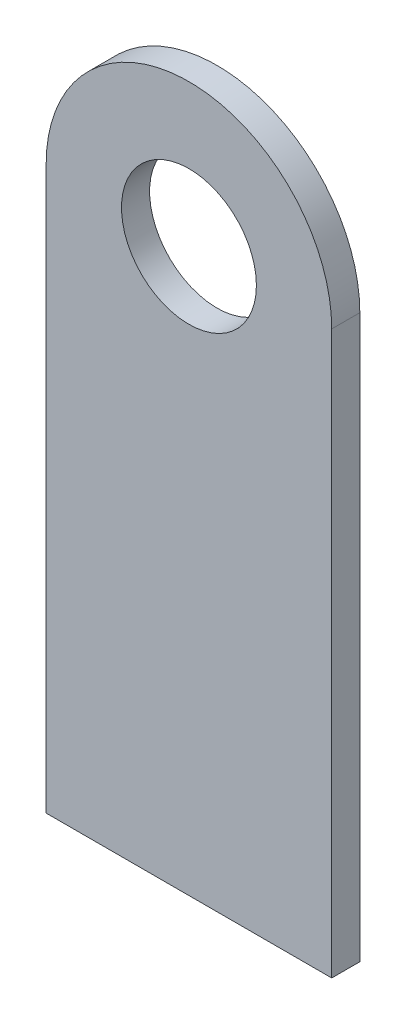
ISO-10303-21;
HEADER;
FILE_DESCRIPTION(('STEP AP214'),'2;1');
FILE_NAME('part.step','',(''),(''),'','','');
FILE_SCHEMA(('AUTOMOTIVE_DESIGN { 1 0 10303 214 1 1 1 1 }'));
ENDSEC;
DATA;
#1=APPLICATION_CONTEXT('core data for automotive mechanical design processes');
#2=APPLICATION_PROTOCOL_DEFINITION('international standard','automotive_design',2000,#1);
#3=PRODUCT_CONTEXT('',#1,'mechanical');
#4=PRODUCT('Part','Part','',(#3));
#5=PRODUCT_RELATED_PRODUCT_CATEGORY('part','',(#4));
#6=PRODUCT_DEFINITION_FORMATION('','',#4);
#7=PRODUCT_DEFINITION_CONTEXT('part definition',#1,'design');
#8=PRODUCT_DEFINITION('design','',#6,#7);
#9=PRODUCT_DEFINITION_SHAPE('','',#8);
#10=(LENGTH_UNIT() NAMED_UNIT(*) SI_UNIT(.MILLI.,.METRE.));
#11=(NAMED_UNIT(*) PLANE_ANGLE_UNIT() SI_UNIT($,.RADIAN.));
#12=(NAMED_UNIT(*) SI_UNIT($,.STERADIAN.) SOLID_ANGLE_UNIT());
#13=UNCERTAINTY_MEASURE_WITH_UNIT(LENGTH_MEASURE(1.E-05),#10,'distance_accuracy_value','');
#14=(GEOMETRIC_REPRESENTATION_CONTEXT(3) GLOBAL_UNCERTAINTY_ASSIGNED_CONTEXT((#13)) GLOBAL_UNIT_ASSIGNED_CONTEXT((#10,
#11,#12)) REPRESENTATION_CONTEXT('',''));
#15=CARTESIAN_POINT('',(0.,0.,0.));
#16=DIRECTION('',(0.,0.,1.));
#17=DIRECTION('',(1.,0.,0.));
#18=AXIS2_PLACEMENT_3D('',#15,#16,#17);
#19=CARTESIAN_POINT('',(0.,0.,2.5));
#20=DIRECTION('',(0.,0.,1.));
#21=DIRECTION('',(1.,0.,0.));
#22=AXIS2_PLACEMENT_3D('',#19,#20,#21);
#23=PLANE('',#22);
#24=CARTESIAN_POINT('',(0.,0.,2.5));
#25=DIRECTION('',(0.,0.,1.));
#26=DIRECTION('',(1.,0.,0.));
#27=AXIS2_PLACEMENT_3D('',#24,#25,#26);
#28=CIRCLE('',#27,12.7);
#29=CARTESIAN_POINT('',(12.7,0.,2.5));
#30=VERTEX_POINT('',#29);
#31=CARTESIAN_POINT('',(-12.7,0.,2.5));
#32=VERTEX_POINT('',#31);
#33=EDGE_CURVE('E85',#30,#32,#28,.T.);
#34=ORIENTED_EDGE('',*,*,#33,.T.);
#35=DIRECTION('',(0.,-1.,0.));
#36=VECTOR('',#35,1.);
#37=CARTESIAN_POINT('',(-12.7,0.,2.5));
#38=LINE('',#37,#36);
#39=CARTESIAN_POINT('',(-12.7,-50.,2.5));
#40=VERTEX_POINT('',#39);
#41=EDGE_CURVE('E80',#32,#40,#38,.T.);
#42=ORIENTED_EDGE('',*,*,#41,.T.);
#43=DIRECTION('',(1.,0.,0.));
#44=VECTOR('',#43,1.);
#45=CARTESIAN_POINT('',(-12.7,-50.,2.5));
#46=LINE('',#45,#44);
#47=CARTESIAN_POINT('',(12.7,-50.,2.5));
#48=VERTEX_POINT('',#47);
#49=EDGE_CURVE('E83',#40,#48,#46,.T.);
#50=ORIENTED_EDGE('',*,*,#49,.T.);
#51=DIRECTION('',(0.,1.,0.));
#52=VECTOR('',#51,1.);
#53=CARTESIAN_POINT('',(12.7,-50.,2.5));
#54=LINE('',#53,#52);
#55=EDGE_CURVE('E50',#48,#30,#54,.T.);
#56=ORIENTED_EDGE('',*,*,#55,.T.);
#57=EDGE_LOOP('',(#34,#42,#50,#56));
#58=FACE_BOUND('',#57,.T.);
#59=CARTESIAN_POINT('',(0.,0.,2.5));
#60=DIRECTION('',(0.,0.,1.));
#61=DIRECTION('',(1.,0.,0.));
#62=AXIS2_PLACEMENT_3D('',#59,#60,#61);
#63=CIRCLE('',#62,6.);
#64=CARTESIAN_POINT('',(6.,0.,2.5));
#65=VERTEX_POINT('',#64);
#66=EDGE_CURVE('E100',#65,#65,#63,.T.);
#67=ORIENTED_EDGE('',*,*,#66,.F.);
#68=EDGE_LOOP('',(#67));
#69=FACE_BOUND('',#68,.T.);
#70=ADVANCED_FACE('F33',(#58,#69),#23,.T.);
#71=CARTESIAN_POINT('',(0.,0.,0.));
#72=DIRECTION('',(0.,0.,1.));
#73=DIRECTION('',(1.,0.,0.));
#74=AXIS2_PLACEMENT_3D('',#71,#72,#73);
#75=PLANE('',#74);
#76=CARTESIAN_POINT('',(0.,0.,0.));
#77=DIRECTION('',(0.,0.,1.));
#78=DIRECTION('',(1.,0.,0.));
#79=AXIS2_PLACEMENT_3D('',#76,#77,#78);
#80=CIRCLE('',#79,12.7);
#81=CARTESIAN_POINT('',(12.7,0.,0.));
#82=VERTEX_POINT('',#81);
#83=CARTESIAN_POINT('',(-12.7,0.,0.));
#84=VERTEX_POINT('',#83);
#85=EDGE_CURVE('E97',#82,#84,#80,.T.);
#86=ORIENTED_EDGE('',*,*,#85,.F.);
#87=DIRECTION('',(0.,1.,0.));
#88=VECTOR('',#87,1.);
#89=CARTESIAN_POINT('',(12.7,-50.,0.));
#90=LINE('',#89,#88);
#91=CARTESIAN_POINT('',(12.7,-50.,0.));
#92=VERTEX_POINT('',#91);
#93=EDGE_CURVE('E73',#92,#82,#90,.T.);
#94=ORIENTED_EDGE('',*,*,#93,.F.);
#95=DIRECTION('',(1.,0.,0.));
#96=VECTOR('',#95,1.);
#97=CARTESIAN_POINT('',(-12.7,-50.,0.));
#98=LINE('',#97,#96);
#99=CARTESIAN_POINT('',(-12.7,-50.,0.));
#100=VERTEX_POINT('',#99);
#101=EDGE_CURVE('E67',#100,#92,#98,.T.);
#102=ORIENTED_EDGE('',*,*,#101,.F.);
#103=DIRECTION('',(0.,-1.,0.));
#104=VECTOR('',#103,1.);
#105=CARTESIAN_POINT('',(-12.7,0.,0.));
#106=LINE('',#105,#104);
#107=EDGE_CURVE('E89',#84,#100,#106,.T.);
#108=ORIENTED_EDGE('',*,*,#107,.F.);
#109=EDGE_LOOP('',(#86,#94,#102,#108));
#110=FACE_BOUND('',#109,.T.);
#111=CARTESIAN_POINT('',(0.,0.,0.));
#112=DIRECTION('',(0.,0.,1.));
#113=DIRECTION('',(1.,0.,0.));
#114=AXIS2_PLACEMENT_3D('',#111,#112,#113);
#115=CIRCLE('',#114,6.);
#116=CARTESIAN_POINT('',(6.,0.,0.));
#117=VERTEX_POINT('',#116);
#118=EDGE_CURVE('E112',#117,#117,#115,.T.);
#119=ORIENTED_EDGE('',*,*,#118,.T.);
#120=EDGE_LOOP('',(#119));
#121=FACE_BOUND('',#120,.T.);
#122=ADVANCED_FACE('F108',(#110,#121),#75,.F.);
#123=CARTESIAN_POINT('',(0.,0.,2.5));
#124=DIRECTION('',(0.,0.,-1.));
#125=DIRECTION('',(-1.,0.,0.));
#126=AXIS2_PLACEMENT_3D('',#123,#124,#125);
#127=CYLINDRICAL_SURFACE('',#126,12.7);
#128=ORIENTED_EDGE('',*,*,#85,.T.);
#129=DIRECTION('',(0.,0.,-1.));
#130=VECTOR('',#129,1.);
#131=CARTESIAN_POINT('',(-12.7,0.,2.5));
#132=LINE('',#131,#130);
#133=EDGE_CURVE('E11',#32,#84,#132,.T.);
#134=ORIENTED_EDGE('',*,*,#133,.F.);
#135=ORIENTED_EDGE('',*,*,#33,.F.);
#136=DIRECTION('',(0.,0.,-1.));
#137=VECTOR('',#136,1.);
#138=CARTESIAN_POINT('',(12.7,0.,2.5));
#139=LINE('',#138,#137);
#140=EDGE_CURVE('E93',#30,#82,#139,.T.);
#141=ORIENTED_EDGE('',*,*,#140,.T.);
#142=EDGE_LOOP('',(#128,#134,#135,#141));
#143=FACE_BOUND('',#142,.T.);
#144=ADVANCED_FACE('F35',(#143),#127,.T.);
#145=CARTESIAN_POINT('',(-12.7,0.,2.5));
#146=DIRECTION('',(1.,0.,0.));
#147=DIRECTION('',(0.,0.,-1.));
#148=AXIS2_PLACEMENT_3D('',#145,#146,#147);
#149=PLANE('',#148);
#150=ORIENTED_EDGE('',*,*,#107,.T.);
#151=DIRECTION('',(0.,0.,-1.));
#152=VECTOR('',#151,1.);
#153=CARTESIAN_POINT('',(-12.7,-50.,2.5));
#154=LINE('',#153,#152);
#155=EDGE_CURVE('E42',#40,#100,#154,.T.);
#156=ORIENTED_EDGE('',*,*,#155,.F.);
#157=ORIENTED_EDGE('',*,*,#41,.F.);
#158=ORIENTED_EDGE('',*,*,#133,.T.);
#159=EDGE_LOOP('',(#150,#156,#157,#158));
#160=FACE_BOUND('',#159,.T.);
#161=ADVANCED_FACE('F88',(#160),#149,.F.);
#162=CARTESIAN_POINT('',(-12.7,-50.,2.5));
#163=DIRECTION('',(0.,1.,0.));
#164=DIRECTION('',(0.,0.,1.));
#165=AXIS2_PLACEMENT_3D('',#162,#163,#164);
#166=PLANE('',#165);
#167=ORIENTED_EDGE('',*,*,#101,.T.);
#168=DIRECTION('',(0.,0.,-1.));
#169=VECTOR('',#168,1.);
#170=CARTESIAN_POINT('',(12.7,-50.,2.5));
#171=LINE('',#170,#169);
#172=EDGE_CURVE('E90',#48,#92,#171,.T.);
#173=ORIENTED_EDGE('',*,*,#172,.F.);
#174=ORIENTED_EDGE('',*,*,#49,.F.);
#175=ORIENTED_EDGE('',*,*,#155,.T.);
#176=EDGE_LOOP('',(#167,#173,#174,#175));
#177=FACE_BOUND('',#176,.T.);
#178=ADVANCED_FACE('F91',(#177),#166,.F.);
#179=CARTESIAN_POINT('',(12.7,-50.,2.5));
#180=DIRECTION('',(-1.,0.,0.));
#181=DIRECTION('',(0.,0.,1.));
#182=AXIS2_PLACEMENT_3D('',#179,#180,#181);
#183=PLANE('',#182);
#184=ORIENTED_EDGE('',*,*,#93,.T.);
#185=ORIENTED_EDGE('',*,*,#140,.F.);
#186=ORIENTED_EDGE('',*,*,#55,.F.);
#187=ORIENTED_EDGE('',*,*,#172,.T.);
#188=EDGE_LOOP('',(#184,#185,#186,#187));
#189=FACE_BOUND('',#188,.T.);
#190=ADVANCED_FACE('F105',(#189),#183,.F.);
#191=CARTESIAN_POINT('',(0.,0.,2.5));
#192=DIRECTION('',(0.,0.,-1.));
#193=DIRECTION('',(-1.,0.,0.));
#194=AXIS2_PLACEMENT_3D('',#191,#192,#193);
#195=CYLINDRICAL_SURFACE('',#194,6.);
#196=ORIENTED_EDGE('',*,*,#66,.T.);
#197=EDGE_LOOP('',(#196));
#198=FACE_BOUND('',#197,.T.);
#199=ORIENTED_EDGE('',*,*,#118,.F.);
#200=EDGE_LOOP('',(#199));
#201=FACE_BOUND('',#200,.T.);
#202=ADVANCED_FACE('F118',(#198,#201),#195,.F.);
#203=CLOSED_SHELL('',(#70,#122,#144,#161,#178,#190,#202));
#204=MANIFOLD_SOLID_BREP('B2',#203);
#205=ADVANCED_BREP_SHAPE_REPRESENTATION('',(#18,#204),#14);
#206=SHAPE_DEFINITION_REPRESENTATION(#9,#205);
ENDSEC;
END-ISO-10303-21;
